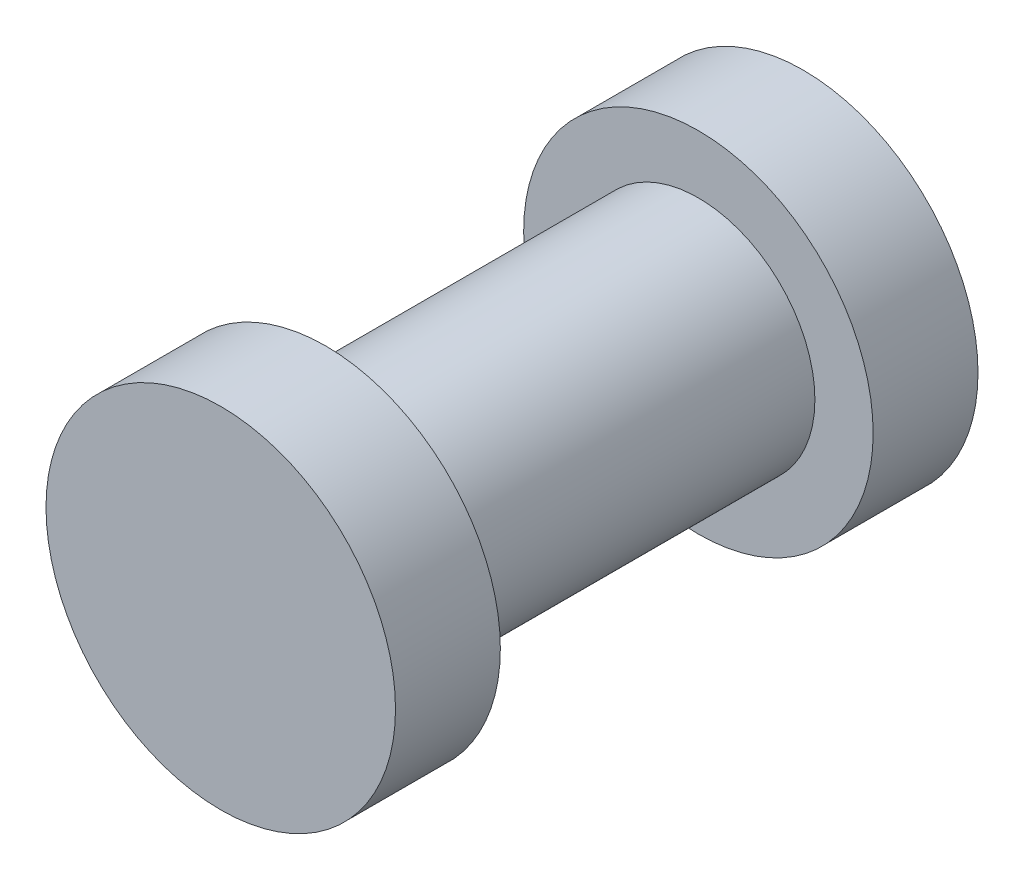
ISO-10303-21;
HEADER;
FILE_DESCRIPTION(('STEP AP214'),'2;1');
FILE_NAME('part.step','',(''),(''),'','','');
FILE_SCHEMA(('AUTOMOTIVE_DESIGN { 1 0 10303 214 1 1 1 1 }'));
ENDSEC;
DATA;
#1=APPLICATION_CONTEXT('core data for automotive mechanical design processes');
#2=APPLICATION_PROTOCOL_DEFINITION('international standard','automotive_design',2000,#1);
#3=PRODUCT_CONTEXT('',#1,'mechanical');
#4=PRODUCT('Part','Part','',(#3));
#5=PRODUCT_RELATED_PRODUCT_CATEGORY('part','',(#4));
#6=PRODUCT_DEFINITION_FORMATION('','',#4);
#7=PRODUCT_DEFINITION_CONTEXT('part definition',#1,'design');
#8=PRODUCT_DEFINITION('design','',#6,#7);
#9=PRODUCT_DEFINITION_SHAPE('','',#8);
#10=(LENGTH_UNIT() NAMED_UNIT(*) SI_UNIT(.MILLI.,.METRE.));
#11=(NAMED_UNIT(*) PLANE_ANGLE_UNIT() SI_UNIT($,.RADIAN.));
#12=(NAMED_UNIT(*) SI_UNIT($,.STERADIAN.) SOLID_ANGLE_UNIT());
#13=UNCERTAINTY_MEASURE_WITH_UNIT(LENGTH_MEASURE(1.E-05),#10,'distance_accuracy_value','');
#14=(GEOMETRIC_REPRESENTATION_CONTEXT(3) GLOBAL_UNCERTAINTY_ASSIGNED_CONTEXT((#13)) GLOBAL_UNIT_ASSIGNED_CONTEXT((#10,
#11,#12)) REPRESENTATION_CONTEXT('',''));
#15=CARTESIAN_POINT('',(0.,0.,0.));
#16=DIRECTION('',(0.,0.,1.));
#17=DIRECTION('',(1.,0.,0.));
#18=AXIS2_PLACEMENT_3D('',#15,#16,#17);
#19=CARTESIAN_POINT('',(0.,0.,5.));
#20=DIRECTION('',(0.,0.,-1.));
#21=DIRECTION('',(-1.,0.,0.));
#22=AXIS2_PLACEMENT_3D('',#19,#20,#21);
#23=CYLINDRICAL_SURFACE('',#22,2.);
#24=CARTESIAN_POINT('',(0.,0.,3.2));
#25=DIRECTION('',(0.,0.,1.));
#26=DIRECTION('',(1.,0.,0.));
#27=AXIS2_PLACEMENT_3D('',#24,#25,#26);
#28=CIRCLE('',#27,2.);
#29=CARTESIAN_POINT('',(2.,0.,3.2));
#30=VERTEX_POINT('',#29);
#31=EDGE_CURVE('E43',#30,#30,#28,.T.);
#32=ORIENTED_EDGE('',*,*,#31,.F.);
#33=EDGE_LOOP('',(#32));
#34=FACE_BOUND('',#33,.T.);
#35=CARTESIAN_POINT('',(0.,0.,-3.2));
#36=DIRECTION('',(0.,0.,-1.));
#37=DIRECTION('',(-1.,0.,0.));
#38=AXIS2_PLACEMENT_3D('',#35,#36,#37);
#39=CIRCLE('',#38,2.);
#40=CARTESIAN_POINT('',(-2.,0.,-3.2));
#41=VERTEX_POINT('',#40);
#42=EDGE_CURVE('E10',#41,#41,#39,.T.);
#43=ORIENTED_EDGE('',*,*,#42,.F.);
#44=EDGE_LOOP('',(#43));
#45=FACE_BOUND('',#44,.T.);
#46=ADVANCED_FACE('F37',(#34,#45),#23,.T.);
#47=CARTESIAN_POINT('',(0.,0.,3.2));
#48=DIRECTION('',(0.,0.,1.));
#49=DIRECTION('',(1.,0.,0.));
#50=AXIS2_PLACEMENT_3D('',#47,#48,#49);
#51=CYLINDRICAL_SURFACE('',#50,3.);
#52=CARTESIAN_POINT('',(0.,0.,3.2));
#53=DIRECTION('',(0.,0.,1.));
#54=DIRECTION('',(1.,0.,0.));
#55=AXIS2_PLACEMENT_3D('',#52,#53,#54);
#56=CIRCLE('',#55,3.);
#57=CARTESIAN_POINT('',(3.,0.,3.2));
#58=VERTEX_POINT('',#57);
#59=EDGE_CURVE('E47',#58,#58,#56,.T.);
#60=ORIENTED_EDGE('',*,*,#59,.T.);
#61=EDGE_LOOP('',(#60));
#62=FACE_BOUND('',#61,.T.);
#63=CARTESIAN_POINT('',(0.,0.,5.));
#64=DIRECTION('',(0.,0.,1.));
#65=DIRECTION('',(1.,0.,0.));
#66=AXIS2_PLACEMENT_3D('',#63,#64,#65);
#67=CIRCLE('',#66,3.);
#68=CARTESIAN_POINT('',(3.,0.,5.));
#69=VERTEX_POINT('',#68);
#70=EDGE_CURVE('E51',#69,#69,#67,.T.);
#71=ORIENTED_EDGE('',*,*,#70,.F.);
#72=EDGE_LOOP('',(#71));
#73=FACE_BOUND('',#72,.T.);
#74=ADVANCED_FACE('F80',(#62,#73),#51,.T.);
#75=CARTESIAN_POINT('',(0.,0.,3.2));
#76=DIRECTION('',(0.,0.,1.));
#77=DIRECTION('',(1.,0.,0.));
#78=AXIS2_PLACEMENT_3D('',#75,#76,#77);
#79=PLANE('',#78);
#80=ORIENTED_EDGE('',*,*,#31,.T.);
#81=EDGE_LOOP('',(#80));
#82=FACE_BOUND('',#81,.T.);
#83=ORIENTED_EDGE('',*,*,#59,.F.);
#84=EDGE_LOOP('',(#83));
#85=FACE_BOUND('',#84,.T.);
#86=ADVANCED_FACE('F85',(#82,#85),#79,.F.);
#87=CARTESIAN_POINT('',(0.,0.,5.));
#88=DIRECTION('',(0.,0.,1.));
#89=DIRECTION('',(1.,0.,0.));
#90=AXIS2_PLACEMENT_3D('',#87,#88,#89);
#91=PLANE('',#90);
#92=ORIENTED_EDGE('',*,*,#70,.T.);
#93=EDGE_LOOP('',(#92));
#94=FACE_BOUND('',#93,.T.);
#95=ADVANCED_FACE('F68',(#94),#91,.T.);
#96=CARTESIAN_POINT('',(0.,0.,-3.2));
#97=DIRECTION('',(0.,0.,-1.));
#98=DIRECTION('',(-1.,0.,0.));
#99=AXIS2_PLACEMENT_3D('',#96,#97,#98);
#100=CYLINDRICAL_SURFACE('',#99,3.);
#101=CARTESIAN_POINT('',(0.,0.,-3.2));
#102=DIRECTION('',(0.,0.,1.));
#103=DIRECTION('',(1.,0.,0.));
#104=AXIS2_PLACEMENT_3D('',#101,#102,#103);
#105=CIRCLE('',#104,3.);
#106=CARTESIAN_POINT('',(3.,0.,-3.2));
#107=VERTEX_POINT('',#106);
#108=EDGE_CURVE('E55',#107,#107,#105,.T.);
#109=ORIENTED_EDGE('',*,*,#108,.F.);
#110=EDGE_LOOP('',(#109));
#111=FACE_BOUND('',#110,.T.);
#112=CARTESIAN_POINT('',(0.,0.,-5.));
#113=DIRECTION('',(0.,0.,1.));
#114=DIRECTION('',(1.,0.,0.));
#115=AXIS2_PLACEMENT_3D('',#112,#113,#114);
#116=CIRCLE('',#115,3.);
#117=CARTESIAN_POINT('',(3.,0.,-5.));
#118=VERTEX_POINT('',#117);
#119=EDGE_CURVE('E57',#118,#118,#116,.T.);
#120=ORIENTED_EDGE('',*,*,#119,.T.);
#121=EDGE_LOOP('',(#120));
#122=FACE_BOUND('',#121,.T.);
#123=ADVANCED_FACE('F65',(#111,#122),#100,.T.);
#124=CARTESIAN_POINT('',(0.,0.,-3.2));
#125=DIRECTION('',(0.,0.,-1.));
#126=DIRECTION('',(1.,0.,0.));
#127=AXIS2_PLACEMENT_3D('',#124,#125,#126);
#128=PLANE('',#127);
#129=ORIENTED_EDGE('',*,*,#42,.T.);
#130=EDGE_LOOP('',(#129));
#131=FACE_BOUND('',#130,.T.);
#132=ORIENTED_EDGE('',*,*,#108,.T.);
#133=EDGE_LOOP('',(#132));
#134=FACE_BOUND('',#133,.T.);
#135=ADVANCED_FACE('F63',(#131,#134),#128,.F.);
#136=CARTESIAN_POINT('',(0.,0.,-5.));
#137=DIRECTION('',(0.,0.,1.));
#138=DIRECTION('',(1.,0.,0.));
#139=AXIS2_PLACEMENT_3D('',#136,#137,#138);
#140=PLANE('',#139);
#141=ORIENTED_EDGE('',*,*,#119,.F.);
#142=EDGE_LOOP('',(#141));
#143=FACE_BOUND('',#142,.T.);
#144=ADVANCED_FACE('F72',(#143),#140,.F.);
#145=CLOSED_SHELL('',(#46,#74,#86,#95,#123,#135,#144));
#146=MANIFOLD_SOLID_BREP('B2',#145);
#147=ADVANCED_BREP_SHAPE_REPRESENTATION('',(#18,#146),#14);
#148=SHAPE_DEFINITION_REPRESENTATION(#9,#147);
ENDSEC;
END-ISO-10303-21;
